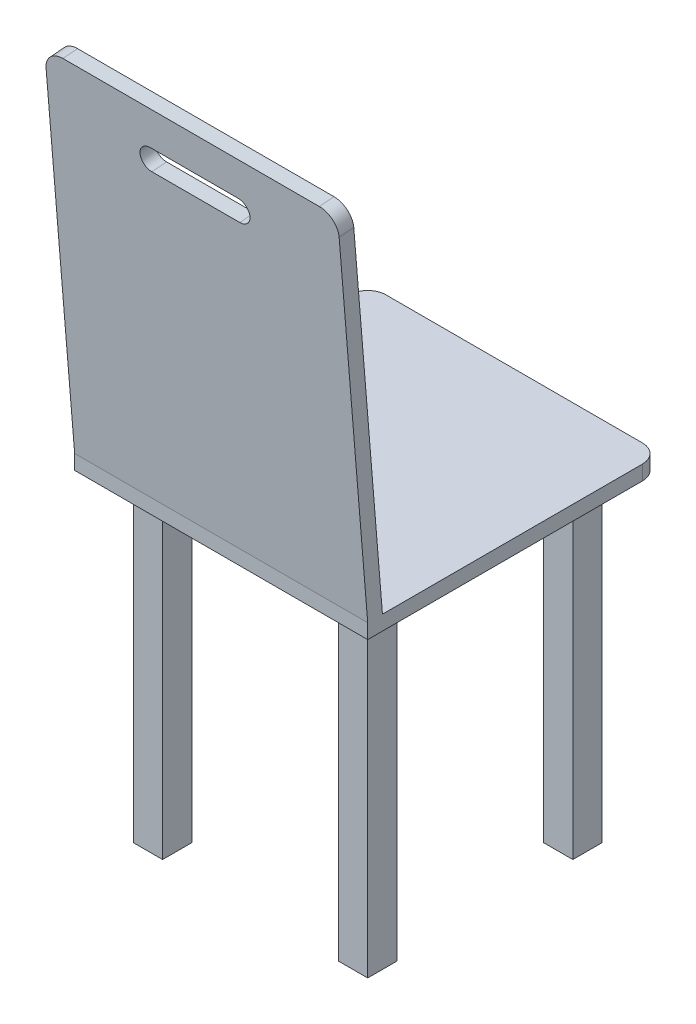
ISO-10303-21;
HEADER;
FILE_DESCRIPTION(('STEP AP214'),'2;1');
FILE_NAME('part.step','',(''),(''),'','','');
FILE_SCHEMA(('AUTOMOTIVE_DESIGN { 1 0 10303 214 1 1 1 1 }'));
ENDSEC;
DATA;
#1=APPLICATION_CONTEXT('core data for automotive mechanical design processes');
#2=APPLICATION_PROTOCOL_DEFINITION('international standard','automotive_design',2000,#1);
#3=PRODUCT_CONTEXT('',#1,'mechanical');
#4=PRODUCT('Part','Part','',(#3));
#5=PRODUCT_RELATED_PRODUCT_CATEGORY('part','',(#4));
#6=PRODUCT_DEFINITION_FORMATION('','',#4);
#7=PRODUCT_DEFINITION_CONTEXT('part definition',#1,'design');
#8=PRODUCT_DEFINITION('design','',#6,#7);
#9=PRODUCT_DEFINITION_SHAPE('','',#8);
#10=(LENGTH_UNIT() NAMED_UNIT(*) SI_UNIT(.MILLI.,.METRE.));
#11=(NAMED_UNIT(*) PLANE_ANGLE_UNIT() SI_UNIT($,.RADIAN.));
#12=(NAMED_UNIT(*) SI_UNIT($,.STERADIAN.) SOLID_ANGLE_UNIT());
#13=UNCERTAINTY_MEASURE_WITH_UNIT(LENGTH_MEASURE(1.E-05),#10,'distance_accuracy_value','');
#14=(GEOMETRIC_REPRESENTATION_CONTEXT(3) GLOBAL_UNCERTAINTY_ASSIGNED_CONTEXT((#13)) GLOBAL_UNIT_ASSIGNED_CONTEXT((#10,
#11,#12)) REPRESENTATION_CONTEXT('',''));
#15=CARTESIAN_POINT('',(0.,0.,0.));
#16=DIRECTION('',(0.,0.,1.));
#17=DIRECTION('',(1.,0.,0.));
#18=AXIS2_PLACEMENT_3D('',#15,#16,#17);
#19=CARTESIAN_POINT('',(40.,0.,0.));
#20=DIRECTION('',(0.,1.,0.));
#21=DIRECTION('',(0.,0.,1.));
#22=AXIS2_PLACEMENT_3D('',#19,#20,#21);
#23=PLANE('',#22);
#24=DIRECTION('',(0.,0.,-1.));
#25=VECTOR('',#24,1.);
#26=CARTESIAN_POINT('',(4.,0.,-32.));
#27=LINE('',#26,#25);
#28=CARTESIAN_POINT('',(4.,0.,-32.));
#29=VERTEX_POINT('',#28);
#30=CARTESIAN_POINT('',(4.,0.,-36.));
#31=VERTEX_POINT('',#30);
#32=EDGE_CURVE('E266',#29,#31,#27,.T.);
#33=ORIENTED_EDGE('',*,*,#32,.F.);
#34=DIRECTION('',(-1.,0.,0.));
#35=VECTOR('',#34,1.);
#36=CARTESIAN_POINT('',(4.,0.,-32.));
#37=LINE('',#36,#35);
#38=CARTESIAN_POINT('',(8.,0.,-32.));
#39=VERTEX_POINT('',#38);
#40=EDGE_CURVE('E282',#39,#29,#37,.T.);
#41=ORIENTED_EDGE('',*,*,#40,.F.);
#42=DIRECTION('',(0.,0.,1.));
#43=VECTOR('',#42,1.);
#44=CARTESIAN_POINT('',(8.,0.,-32.));
#45=LINE('',#44,#43);
#46=CARTESIAN_POINT('',(8.,0.,-36.));
#47=VERTEX_POINT('',#46);
#48=EDGE_CURVE('E295',#47,#39,#45,.T.);
#49=ORIENTED_EDGE('',*,*,#48,.F.);
#50=DIRECTION('',(1.,0.,0.));
#51=VECTOR('',#50,1.);
#52=CARTESIAN_POINT('',(4.,0.,-36.));
#53=LINE('',#52,#51);
#54=EDGE_CURVE('E271',#31,#47,#53,.T.);
#55=ORIENTED_EDGE('',*,*,#54,.F.);
#56=EDGE_LOOP('',(#33,#41,#49,#55));
#57=FACE_BOUND('',#56,.T.);
#58=DIRECTION('',(0.,0.,1.));
#59=VECTOR('',#58,1.);
#60=CARTESIAN_POINT('',(36.,0.,-4.));
#61=LINE('',#60,#59);
#62=CARTESIAN_POINT('',(36.,0.,-8.));
#63=VERTEX_POINT('',#62);
#64=CARTESIAN_POINT('',(36.,0.,-4.));
#65=VERTEX_POINT('',#64);
#66=EDGE_CURVE('E362',#63,#65,#61,.T.);
#67=ORIENTED_EDGE('',*,*,#66,.F.);
#68=DIRECTION('',(1.,0.,0.));
#69=VECTOR('',#68,1.);
#70=CARTESIAN_POINT('',(36.,0.,-8.));
#71=LINE('',#70,#69);
#72=CARTESIAN_POINT('',(32.,0.,-8.));
#73=VERTEX_POINT('',#72);
#74=EDGE_CURVE('E368',#73,#63,#71,.T.);
#75=ORIENTED_EDGE('',*,*,#74,.F.);
#76=DIRECTION('',(0.,0.,-1.));
#77=VECTOR('',#76,1.);
#78=CARTESIAN_POINT('',(32.,0.,-4.));
#79=LINE('',#78,#77);
#80=CARTESIAN_POINT('',(32.,0.,-4.));
#81=VERTEX_POINT('',#80);
#82=EDGE_CURVE('E385',#81,#73,#79,.T.);
#83=ORIENTED_EDGE('',*,*,#82,.F.);
#84=DIRECTION('',(-1.,0.,0.));
#85=VECTOR('',#84,1.);
#86=CARTESIAN_POINT('',(36.,0.,-4.));
#87=LINE('',#86,#85);
#88=EDGE_CURVE('E381',#65,#81,#87,.T.);
#89=ORIENTED_EDGE('',*,*,#88,.F.);
#90=EDGE_LOOP('',(#67,#75,#83,#89));
#91=FACE_BOUND('',#90,.T.);
#92=DIRECTION('',(-1.,0.,0.));
#93=VECTOR('',#92,1.);
#94=CARTESIAN_POINT('',(40.,0.,-40.));
#95=LINE('',#94,#93);
#96=CARTESIAN_POINT('',(37.5,0.,-40.));
#97=VERTEX_POINT('',#96);
#98=CARTESIAN_POINT('',(2.5,0.,-40.));
#99=VERTEX_POINT('',#98);
#100=EDGE_CURVE('E507',#97,#99,#95,.T.);
#101=ORIENTED_EDGE('',*,*,#100,.F.);
#102=CARTESIAN_POINT('',(37.5,0.,-37.5));
#103=DIRECTION('',(0.,1.,0.));
#104=DIRECTION('',(0.,0.,1.));
#105=AXIS2_PLACEMENT_3D('',#102,#103,#104);
#106=CIRCLE('',#105,2.5);
#107=CARTESIAN_POINT('',(40.,0.,-37.5));
#108=VERTEX_POINT('',#107);
#109=EDGE_CURVE('E539',#97,#108,#106,.F.);
#110=ORIENTED_EDGE('',*,*,#109,.T.);
#111=DIRECTION('',(0.,0.,-1.));
#112=VECTOR('',#111,1.);
#113=CARTESIAN_POINT('',(40.,0.,0.));
#114=LINE('',#113,#112);
#115=CARTESIAN_POINT('',(40.,0.,0.));
#116=VERTEX_POINT('',#115);
#117=EDGE_CURVE('E456',#116,#108,#114,.T.);
#118=ORIENTED_EDGE('',*,*,#117,.F.);
#119=DIRECTION('',(-1.,0.,0.));
#120=VECTOR('',#119,1.);
#121=CARTESIAN_POINT('',(40.,0.,0.));
#122=LINE('',#121,#120);
#123=CARTESIAN_POINT('',(0.,0.,0.));
#124=VERTEX_POINT('',#123);
#125=EDGE_CURVE('E511',#116,#124,#122,.T.);
#126=ORIENTED_EDGE('',*,*,#125,.T.);
#127=DIRECTION('',(0.,0.,-1.));
#128=VECTOR('',#127,1.);
#129=CARTESIAN_POINT('',(0.,0.,0.));
#130=LINE('',#129,#128);
#131=CARTESIAN_POINT('',(0.,0.,-37.5));
#132=VERTEX_POINT('',#131);
#133=EDGE_CURVE('E475',#124,#132,#130,.T.);
#134=ORIENTED_EDGE('',*,*,#133,.T.);
#135=CARTESIAN_POINT('',(2.5,0.,-37.5));
#136=DIRECTION('',(0.,1.,0.));
#137=DIRECTION('',(0.,0.,1.));
#138=AXIS2_PLACEMENT_3D('',#135,#136,#137);
#139=CIRCLE('',#138,2.5);
#140=EDGE_CURVE('E536',#132,#99,#139,.F.);
#141=ORIENTED_EDGE('',*,*,#140,.T.);
#142=EDGE_LOOP('',(#101,#110,#118,#126,#134,#141));
#143=FACE_BOUND('',#142,.T.);
#144=DIRECTION('',(0.,0.,-1.));
#145=VECTOR('',#144,1.);
#146=CARTESIAN_POINT('',(4.,0.,-4.));
#147=LINE('',#146,#145);
#148=CARTESIAN_POINT('',(4.,0.,-4.));
#149=VERTEX_POINT('',#148);
#150=CARTESIAN_POINT('',(4.,0.,-8.));
#151=VERTEX_POINT('',#150);
#152=EDGE_CURVE('E317',#149,#151,#147,.T.);
#153=ORIENTED_EDGE('',*,*,#152,.F.);
#154=DIRECTION('',(-1.,0.,0.));
#155=VECTOR('',#154,1.);
#156=CARTESIAN_POINT('',(4.,0.,-4.));
#157=LINE('',#156,#155);
#158=CARTESIAN_POINT('',(8.,0.,-4.));
#159=VERTEX_POINT('',#158);
#160=EDGE_CURVE('E323',#159,#149,#157,.T.);
#161=ORIENTED_EDGE('',*,*,#160,.F.);
#162=DIRECTION('',(0.,0.,1.));
#163=VECTOR('',#162,1.);
#164=CARTESIAN_POINT('',(8.,0.,-4.));
#165=LINE('',#164,#163);
#166=CARTESIAN_POINT('',(8.,0.,-8.));
#167=VERTEX_POINT('',#166);
#168=EDGE_CURVE('E340',#167,#159,#165,.T.);
#169=ORIENTED_EDGE('',*,*,#168,.F.);
#170=DIRECTION('',(1.,0.,0.));
#171=VECTOR('',#170,1.);
#172=CARTESIAN_POINT('',(4.,0.,-8.));
#173=LINE('',#172,#171);
#174=EDGE_CURVE('E336',#151,#167,#173,.T.);
#175=ORIENTED_EDGE('',*,*,#174,.F.);
#176=EDGE_LOOP('',(#153,#161,#169,#175));
#177=FACE_BOUND('',#176,.T.);
#178=DIRECTION('',(0.,0.,-1.));
#179=VECTOR('',#178,1.);
#180=CARTESIAN_POINT('',(32.,0.,-32.));
#181=LINE('',#180,#179);
#182=CARTESIAN_POINT('',(32.,0.,-32.));
#183=VERTEX_POINT('',#182);
#184=CARTESIAN_POINT('',(32.,0.,-36.));
#185=VERTEX_POINT('',#184);
#186=EDGE_CURVE('E264',#183,#185,#181,.T.);
#187=ORIENTED_EDGE('',*,*,#186,.F.);
#188=DIRECTION('',(-1.,0.,0.));
#189=VECTOR('',#188,1.);
#190=CARTESIAN_POINT('',(32.,0.,-32.));
#191=LINE('',#190,#189);
#192=CARTESIAN_POINT('',(36.,0.,-32.));
#193=VERTEX_POINT('',#192);
#194=EDGE_CURVE('E261',#193,#183,#191,.T.);
#195=ORIENTED_EDGE('',*,*,#194,.F.);
#196=DIRECTION('',(0.,0.,1.));
#197=VECTOR('',#196,1.);
#198=CARTESIAN_POINT('',(36.,0.,-32.));
#199=LINE('',#198,#197);
#200=CARTESIAN_POINT('',(36.,0.,-36.));
#201=VERTEX_POINT('',#200);
#202=EDGE_CURVE('E60',#201,#193,#199,.T.);
#203=ORIENTED_EDGE('',*,*,#202,.F.);
#204=DIRECTION('',(1.,0.,0.));
#205=VECTOR('',#204,1.);
#206=CARTESIAN_POINT('',(32.,0.,-36.));
#207=LINE('',#206,#205);
#208=EDGE_CURVE('E55',#185,#201,#207,.T.);
#209=ORIENTED_EDGE('',*,*,#208,.F.);
#210=EDGE_LOOP('',(#187,#195,#203,#209));
#211=FACE_BOUND('',#210,.T.);
#212=ADVANCED_FACE('F39',(#57,#91,#143,#177,#211),#23,.F.);
#213=CARTESIAN_POINT('',(40.,2.,0.));
#214=DIRECTION('',(0.,0.,-1.));
#215=DIRECTION('',(0.,1.,0.));
#216=AXIS2_PLACEMENT_3D('',#213,#214,#215);
#217=PLANE('',#216);
#218=DIRECTION('',(0.,-1.,0.));
#219=VECTOR('',#218,1.);
#220=CARTESIAN_POINT('',(0.,2.,0.));
#221=LINE('',#220,#219);
#222=CARTESIAN_POINT('',(0.,2.,0.));
#223=VERTEX_POINT('',#222);
#224=EDGE_CURVE('E451',#223,#124,#221,.T.);
#225=ORIENTED_EDGE('',*,*,#224,.T.);
#226=ORIENTED_EDGE('',*,*,#125,.F.);
#227=DIRECTION('',(0.,-1.,0.));
#228=VECTOR('',#227,1.);
#229=CARTESIAN_POINT('',(40.,2.,0.));
#230=LINE('',#229,#228);
#231=CARTESIAN_POINT('',(40.,2.,0.));
#232=VERTEX_POINT('',#231);
#233=EDGE_CURVE('E452',#232,#116,#230,.T.);
#234=ORIENTED_EDGE('',*,*,#233,.F.);
#235=DIRECTION('',(-1.,0.,0.));
#236=VECTOR('',#235,1.);
#237=CARTESIAN_POINT('',(40.,2.,0.));
#238=LINE('',#237,#236);
#239=EDGE_CURVE('E471',#232,#223,#238,.T.);
#240=ORIENTED_EDGE('',*,*,#239,.T.);
#241=EDGE_LOOP('',(#225,#226,#234,#240));
#242=FACE_BOUND('',#241,.T.);
#243=ADVANCED_FACE('F593',(#242),#217,.F.);
#244=CARTESIAN_POINT('',(40.,0.,-40.));
#245=DIRECTION('',(0.,0.,1.));
#246=DIRECTION('',(1.,0.,0.));
#247=AXIS2_PLACEMENT_3D('',#244,#245,#246);
#248=PLANE('',#247);
#249=DIRECTION('',(-1.,0.,0.));
#250=VECTOR('',#249,1.);
#251=CARTESIAN_POINT('',(40.,2.,-40.));
#252=LINE('',#251,#250);
#253=CARTESIAN_POINT('',(37.5,2.,-40.));
#254=VERTEX_POINT('',#253);
#255=CARTESIAN_POINT('',(2.5,2.,-40.));
#256=VERTEX_POINT('',#255);
#257=EDGE_CURVE('E503',#254,#256,#252,.T.);
#258=ORIENTED_EDGE('',*,*,#257,.F.);
#259=DIRECTION('',(0.,1.,0.));
#260=VECTOR('',#259,1.);
#261=CARTESIAN_POINT('',(37.5,0.,-40.));
#262=LINE('',#261,#260);
#263=EDGE_CURVE('E533',#254,#97,#262,.F.);
#264=ORIENTED_EDGE('',*,*,#263,.T.);
#265=ORIENTED_EDGE('',*,*,#100,.T.);
#266=DIRECTION('',(0.,1.,0.));
#267=VECTOR('',#266,1.);
#268=CARTESIAN_POINT('',(2.5,0.,-40.));
#269=LINE('',#268,#267);
#270=EDGE_CURVE('E529',#99,#256,#269,.T.);
#271=ORIENTED_EDGE('',*,*,#270,.T.);
#272=EDGE_LOOP('',(#258,#264,#265,#271));
#273=FACE_BOUND('',#272,.T.);
#274=ADVANCED_FACE('F605',(#273),#248,.F.);
#275=CARTESIAN_POINT('',(40.,2.,-40.));
#276=DIRECTION('',(0.,-1.,0.));
#277=DIRECTION('',(0.,0.,-1.));
#278=AXIS2_PLACEMENT_3D('',#275,#276,#277);
#279=PLANE('',#278);
#280=DIRECTION('',(0.,0.,1.));
#281=VECTOR('',#280,1.);
#282=CARTESIAN_POINT('',(40.,2.,-40.));
#283=LINE('',#282,#281);
#284=CARTESIAN_POINT('',(40.,2.,-37.5));
#285=VERTEX_POINT('',#284);
#286=CARTESIAN_POINT('',(40.,2.,-2.01348029888666));
#287=VERTEX_POINT('',#286);
#288=EDGE_CURVE('E461',#285,#287,#283,.T.);
#289=ORIENTED_EDGE('',*,*,#288,.F.);
#290=CARTESIAN_POINT('',(37.5,2.,-37.5));
#291=DIRECTION('',(0.,-1.,0.));
#292=DIRECTION('',(0.,0.,-1.));
#293=AXIS2_PLACEMENT_3D('',#290,#291,#292);
#294=CIRCLE('',#293,2.5);
#295=EDGE_CURVE('E526',#285,#254,#294,.F.);
#296=ORIENTED_EDGE('',*,*,#295,.T.);
#297=ORIENTED_EDGE('',*,*,#257,.T.);
#298=CARTESIAN_POINT('',(2.5,2.,-37.5));
#299=DIRECTION('',(0.,-1.,0.));
#300=DIRECTION('',(0.,0.,-1.));
#301=AXIS2_PLACEMENT_3D('',#298,#299,#300);
#302=CIRCLE('',#301,2.5);
#303=CARTESIAN_POINT('',(0.,2.,-37.5));
#304=VERTEX_POINT('',#303);
#305=EDGE_CURVE('E523',#256,#304,#302,.F.);
#306=ORIENTED_EDGE('',*,*,#305,.T.);
#307=DIRECTION('',(0.,0.,1.));
#308=VECTOR('',#307,1.);
#309=CARTESIAN_POINT('',(0.,2.,-40.));
#310=LINE('',#309,#308);
#311=CARTESIAN_POINT('',(0.,2.,-2.01348029888666));
#312=VERTEX_POINT('',#311);
#313=EDGE_CURVE('E479',#304,#312,#310,.T.);
#314=ORIENTED_EDGE('',*,*,#313,.T.);
#315=DIRECTION('',(-1.,0.,0.));
#316=VECTOR('',#315,1.);
#317=CARTESIAN_POINT('',(40.,2.,-2.01348029888666));
#318=LINE('',#317,#316);
#319=EDGE_CURVE('E499',#287,#312,#318,.T.);
#320=ORIENTED_EDGE('',*,*,#319,.F.);
#321=EDGE_LOOP('',(#289,#296,#297,#306,#314,#320));
#322=FACE_BOUND('',#321,.T.);
#323=ADVANCED_FACE('F603',(#322),#279,.F.);
#324=CARTESIAN_POINT('',(40.,52.1641968263193,2.10492065798135));
#325=DIRECTION('',(0.,-0.0818231262001709,0.996646866256464));
#326=DIRECTION('',(0.,-0.996646866256464,-0.0818231262001709));
#327=AXIS2_PLACEMENT_3D('',#324,#325,#326);
#328=PLANE('',#327);
#329=DIRECTION('',(-1.,0.,0.));
#330=VECTOR('',#329,1.);
#331=CARTESIAN_POINT('',(40.,47.180962495037,1.6958050269805));
#332=LINE('',#331,#330);
#333=CARTESIAN_POINT('',(26.,47.180962495037,1.6958050269805));
#334=VERTEX_POINT('',#333);
#335=CARTESIAN_POINT('',(14.,47.180962495037,1.6958050269805));
#336=VERTEX_POINT('',#335);
#337=EDGE_CURVE('E443',#334,#336,#332,.T.);
#338=ORIENTED_EDGE('',*,*,#337,.T.);
#339=CARTESIAN_POINT('',(14.,45.6859921956523,1.57307033768024));
#340=DIRECTION('',(0.,-0.0818231262001709,0.996646866256464));
#341=DIRECTION('',(0.,-0.996646866256464,-0.0818231262001709));
#342=AXIS2_PLACEMENT_3D('',#339,#340,#341);
#343=CIRCLE('',#342,1.5);
#344=CARTESIAN_POINT('',(14.,44.1910218962676,1.45033564837998));
#345=VERTEX_POINT('',#344);
#346=EDGE_CURVE('E447',#336,#345,#343,.T.);
#347=ORIENTED_EDGE('',*,*,#346,.T.);
#348=DIRECTION('',(1.,0.,0.));
#349=VECTOR('',#348,1.);
#350=CARTESIAN_POINT('',(40.,44.1910218962676,1.45033564837998));
#351=LINE('',#350,#349);
#352=CARTESIAN_POINT('',(26.,44.1910218962676,1.45033564837998));
#353=VERTEX_POINT('',#352);
#354=EDGE_CURVE('E426',#345,#353,#351,.T.);
#355=ORIENTED_EDGE('',*,*,#354,.T.);
#356=CARTESIAN_POINT('',(26.,45.6859921956523,1.57307033768024));
#357=DIRECTION('',(0.,-0.0818231262001709,0.996646866256464));
#358=DIRECTION('',(0.,-0.996646866256464,-0.0818231262001709));
#359=AXIS2_PLACEMENT_3D('',#356,#357,#358);
#360=CIRCLE('',#359,1.5);
#361=EDGE_CURVE('E439',#353,#334,#360,.T.);
#362=ORIENTED_EDGE('',*,*,#361,.T.);
#363=EDGE_LOOP('',(#338,#347,#355,#362));
#364=FACE_BOUND('',#363,.T.);
#365=DIRECTION('',(0.,0.996646866256464,0.0818231262001709));
#366=VECTOR('',#365,1.);
#367=CARTESIAN_POINT('',(0.,52.1641968263193,2.10492065798135));
#368=LINE('',#367,#366);
#369=CARTESIAN_POINT('',(0.,49.6725796606781,1.90036284248092));
#370=VERTEX_POINT('',#369);
#371=EDGE_CURVE('E482',#312,#370,#368,.T.);
#372=ORIENTED_EDGE('',*,*,#371,.T.);
#373=CARTESIAN_POINT('',(2.5,49.6725796606781,1.90036284248092));
#374=DIRECTION('',(0.,-0.0818231262001709,0.996646866256464));
#375=DIRECTION('',(0.,-0.996646866256464,-0.0818231262001709));
#376=AXIS2_PLACEMENT_3D('',#373,#374,#375);
#377=CIRCLE('',#376,2.5);
#378=CARTESIAN_POINT('',(2.5,52.1641968263193,2.10492065798135));
#379=VERTEX_POINT('',#378);
#380=EDGE_CURVE('E11',#370,#379,#377,.F.);
#381=ORIENTED_EDGE('',*,*,#380,.T.);
#382=DIRECTION('',(-1.,0.,0.));
#383=VECTOR('',#382,1.);
#384=CARTESIAN_POINT('',(40.,52.1641968263193,2.10492065798135));
#385=LINE('',#384,#383);
#386=CARTESIAN_POINT('',(37.5,52.1641968263193,2.10492065798135));
#387=VERTEX_POINT('',#386);
#388=EDGE_CURVE('E495',#387,#379,#385,.T.);
#389=ORIENTED_EDGE('',*,*,#388,.F.);
#390=CARTESIAN_POINT('',(37.5,49.6725796606781,1.90036284248092));
#391=DIRECTION('',(0.,-0.0818231262001709,0.996646866256464));
#392=DIRECTION('',(0.,-0.996646866256464,-0.0818231262001709));
#393=AXIS2_PLACEMENT_3D('',#390,#391,#392);
#394=CIRCLE('',#393,2.5);
#395=CARTESIAN_POINT('',(40.,49.6725796606781,1.90036284248092));
#396=VERTEX_POINT('',#395);
#397=EDGE_CURVE('E48',#387,#396,#394,.F.);
#398=ORIENTED_EDGE('',*,*,#397,.T.);
#399=DIRECTION('',(0.,0.996646866256464,0.0818231262001709));
#400=VECTOR('',#399,1.);
#401=CARTESIAN_POINT('',(40.,52.1641968263193,2.10492065798135));
#402=LINE('',#401,#400);
#403=EDGE_CURVE('E464',#287,#396,#402,.T.);
#404=ORIENTED_EDGE('',*,*,#403,.F.);
#405=ORIENTED_EDGE('',*,*,#319,.T.);
#406=EDGE_LOOP('',(#372,#381,#389,#398,#404,#405));
#407=FACE_BOUND('',#406,.T.);
#408=ADVANCED_FACE('F565',(#364,#407),#328,.F.);
#409=CARTESIAN_POINT('',(40.,52.,4.10492065798135));
#410=DIRECTION('',(0.,-0.996646866256464,-0.081823126200171));
#411=DIRECTION('',(0.,0.081823126200171,-0.996646866256464));
#412=AXIS2_PLACEMENT_3D('',#409,#410,#411);
#413=PLANE('',#412);
#414=ORIENTED_EDGE('',*,*,#388,.T.);
#415=DIRECTION('',(0.,-0.081823126200171,0.996646866256464));
#416=VECTOR('',#415,1.);
#417=CARTESIAN_POINT('',(2.5,52.,4.10492065798135));
#418=LINE('',#417,#416);
#419=CARTESIAN_POINT('',(2.5,52.,4.10492065798135));
#420=VERTEX_POINT('',#419);
#421=EDGE_CURVE('E551',#379,#420,#418,.T.);
#422=ORIENTED_EDGE('',*,*,#421,.T.);
#423=DIRECTION('',(-1.,0.,0.));
#424=VECTOR('',#423,1.);
#425=CARTESIAN_POINT('',(40.,52.,4.10492065798135));
#426=LINE('',#425,#424);
#427=CARTESIAN_POINT('',(37.5,52.,4.10492065798135));
#428=VERTEX_POINT('',#427);
#429=EDGE_CURVE('E491',#428,#420,#426,.T.);
#430=ORIENTED_EDGE('',*,*,#429,.F.);
#431=DIRECTION('',(0.,-0.081823126200171,0.996646866256464));
#432=VECTOR('',#431,1.);
#433=CARTESIAN_POINT('',(37.5,52.1641968263193,2.10492065798135));
#434=LINE('',#433,#432);
#435=EDGE_CURVE('E548',#428,#387,#434,.F.);
#436=ORIENTED_EDGE('',*,*,#435,.T.);
#437=EDGE_LOOP('',(#414,#422,#430,#436));
#438=FACE_BOUND('',#437,.T.);
#439=ADVANCED_FACE('F579',(#438),#413,.F.);
#440=CARTESIAN_POINT('',(40.,2.,0.));
#441=DIRECTION('',(0.,0.0818231262001707,-0.996646866256464));
#442=DIRECTION('',(0.,0.996646866256464,0.0818231262001707));
#443=AXIS2_PLACEMENT_3D('',#440,#441,#442);
#444=PLANE('',#443);
#445=DIRECTION('',(1.,0.,0.));
#446=VECTOR('',#445,1.);
#447=CARTESIAN_POINT('',(26.,44.0268250699483,3.45033564837999));
#448=LINE('',#447,#446);
#449=CARTESIAN_POINT('',(14.,44.0268250699483,3.45033564837998));
#450=VERTEX_POINT('',#449);
#451=CARTESIAN_POINT('',(26.,44.0268250699483,3.45033564837999));
#452=VERTEX_POINT('',#451);
#453=EDGE_CURVE('E410',#450,#452,#448,.T.);
#454=ORIENTED_EDGE('',*,*,#453,.F.);
#455=CARTESIAN_POINT('',(14.,45.521795369333,3.57307033768024));
#456=DIRECTION('',(0.,-0.0818231262001708,0.996646866256465));
#457=DIRECTION('',(0.,0.996646866256465,0.0818231262001708));
#458=AXIS2_PLACEMENT_3D('',#455,#456,#457);
#459=CIRCLE('',#458,1.5);
#460=CARTESIAN_POINT('',(14.,47.0167656687177,3.6958050269805));
#461=VERTEX_POINT('',#460);
#462=EDGE_CURVE('E407',#461,#450,#459,.T.);
#463=ORIENTED_EDGE('',*,*,#462,.F.);
#464=DIRECTION('',(-1.,0.,0.));
#465=VECTOR('',#464,1.);
#466=CARTESIAN_POINT('',(14.,47.0167656687177,3.6958050269805));
#467=LINE('',#466,#465);
#468=CARTESIAN_POINT('',(26.,47.0167656687177,3.6958050269805));
#469=VERTEX_POINT('',#468);
#470=EDGE_CURVE('E418',#469,#461,#467,.T.);
#471=ORIENTED_EDGE('',*,*,#470,.F.);
#472=CARTESIAN_POINT('',(26.,45.521795369333,3.57307033768024));
#473=DIRECTION('',(0.,-0.0818231262001708,0.996646866256465));
#474=DIRECTION('',(0.,0.996646866256465,0.0818231262001708));
#475=AXIS2_PLACEMENT_3D('',#472,#473,#474);
#476=CIRCLE('',#475,1.5);
#477=EDGE_CURVE('E414',#452,#469,#476,.T.);
#478=ORIENTED_EDGE('',*,*,#477,.F.);
#479=EDGE_LOOP('',(#454,#463,#471,#478));
#480=FACE_BOUND('',#479,.T.);
#481=ORIENTED_EDGE('',*,*,#429,.T.);
#482=CARTESIAN_POINT('',(2.5,49.5083828343588,3.90036284248092));
#483=DIRECTION('',(0.,0.0818231262001707,-0.996646866256464));
#484=DIRECTION('',(0.,0.996646866256464,0.0818231262001707));
#485=AXIS2_PLACEMENT_3D('',#482,#483,#484);
#486=CIRCLE('',#485,2.5);
#487=CARTESIAN_POINT('',(0.,49.5083828343588,3.90036284248092));
#488=VERTEX_POINT('',#487);
#489=EDGE_CURVE('E558',#420,#488,#486,.F.);
#490=ORIENTED_EDGE('',*,*,#489,.T.);
#491=DIRECTION('',(0.,-0.996646866256464,-0.0818231262001707));
#492=VECTOR('',#491,1.);
#493=CARTESIAN_POINT('',(0.,2.,0.));
#494=LINE('',#493,#492);
#495=EDGE_CURVE('E457',#488,#223,#494,.T.);
#496=ORIENTED_EDGE('',*,*,#495,.T.);
#497=ORIENTED_EDGE('',*,*,#239,.F.);
#498=DIRECTION('',(0.,-0.996646866256464,-0.0818231262001707));
#499=VECTOR('',#498,1.);
#500=CARTESIAN_POINT('',(40.,2.,0.));
#501=LINE('',#500,#499);
#502=CARTESIAN_POINT('',(40.,49.5083828343588,3.90036284248092));
#503=VERTEX_POINT('',#502);
#504=EDGE_CURVE('E468',#503,#232,#501,.T.);
#505=ORIENTED_EDGE('',*,*,#504,.F.);
#506=CARTESIAN_POINT('',(37.5,49.5083828343588,3.90036284248092));
#507=DIRECTION('',(0.,0.0818231262001707,-0.996646866256464));
#508=DIRECTION('',(0.,0.996646866256464,0.0818231262001707));
#509=AXIS2_PLACEMENT_3D('',#506,#507,#508);
#510=CIRCLE('',#509,2.5);
#511=EDGE_CURVE('E555',#503,#428,#510,.F.);
#512=ORIENTED_EDGE('',*,*,#511,.T.);
#513=EDGE_LOOP('',(#481,#490,#496,#497,#505,#512));
#514=FACE_BOUND('',#513,.T.);
#515=ADVANCED_FACE('F576',(#480,#514),#444,.F.);
#516=CARTESIAN_POINT('',(40.,0.,0.));
#517=DIRECTION('',(1.,0.,0.));
#518=DIRECTION('',(0.,0.,-1.));
#519=AXIS2_PLACEMENT_3D('',#516,#517,#518);
#520=PLANE('',#519);
#521=ORIENTED_EDGE('',*,*,#117,.T.);
#522=DIRECTION('',(0.,1.,0.));
#523=VECTOR('',#522,1.);
#524=CARTESIAN_POINT('',(40.,2.,-37.5));
#525=LINE('',#524,#523);
#526=EDGE_CURVE('E519',#108,#285,#525,.T.);
#527=ORIENTED_EDGE('',*,*,#526,.T.);
#528=ORIENTED_EDGE('',*,*,#288,.T.);
#529=ORIENTED_EDGE('',*,*,#403,.T.);
#530=DIRECTION('',(0.,-0.081823126200171,0.996646866256464));
#531=VECTOR('',#530,1.);
#532=CARTESIAN_POINT('',(40.,49.5083828343588,3.90036284248092));
#533=LINE('',#532,#531);
#534=EDGE_CURVE('E515',#396,#503,#533,.T.);
#535=ORIENTED_EDGE('',*,*,#534,.T.);
#536=ORIENTED_EDGE('',*,*,#504,.T.);
#537=ORIENTED_EDGE('',*,*,#233,.T.);
#538=EDGE_LOOP('',(#521,#527,#528,#529,#535,#536,#537));
#539=FACE_BOUND('',#538,.T.);
#540=ADVANCED_FACE('F570',(#539),#520,.T.);
#541=CARTESIAN_POINT('',(0.,0.,0.));
#542=DIRECTION('',(1.,0.,0.));
#543=DIRECTION('',(0.,0.,-1.));
#544=AXIS2_PLACEMENT_3D('',#541,#542,#543);
#545=PLANE('',#544);
#546=ORIENTED_EDGE('',*,*,#313,.F.);
#547=DIRECTION('',(0.,1.,0.));
#548=VECTOR('',#547,1.);
#549=CARTESIAN_POINT('',(0.,0.,-37.5));
#550=LINE('',#549,#548);
#551=EDGE_CURVE('E545',#304,#132,#550,.F.);
#552=ORIENTED_EDGE('',*,*,#551,.T.);
#553=ORIENTED_EDGE('',*,*,#133,.F.);
#554=ORIENTED_EDGE('',*,*,#224,.F.);
#555=ORIENTED_EDGE('',*,*,#495,.F.);
#556=DIRECTION('',(0.,-0.081823126200171,0.996646866256464));
#557=VECTOR('',#556,1.);
#558=CARTESIAN_POINT('',(0.,49.4949927863965,4.06346036711035));
#559=LINE('',#558,#557);
#560=EDGE_CURVE('E542',#488,#370,#559,.F.);
#561=ORIENTED_EDGE('',*,*,#560,.T.);
#562=ORIENTED_EDGE('',*,*,#371,.F.);
#563=EDGE_LOOP('',(#546,#552,#553,#554,#555,#561,#562));
#564=FACE_BOUND('',#563,.T.);
#565=ADVANCED_FACE('F589',(#564),#545,.F.);
#566=CARTESIAN_POINT('',(37.5,0.,-37.5));
#567=DIRECTION('',(0.,-1.,0.));
#568=DIRECTION('',(0.,0.,-1.));
#569=AXIS2_PLACEMENT_3D('',#566,#567,#568);
#570=CYLINDRICAL_SURFACE('',#569,2.5);
#571=ORIENTED_EDGE('',*,*,#109,.F.);
#572=ORIENTED_EDGE('',*,*,#263,.F.);
#573=ORIENTED_EDGE('',*,*,#295,.F.);
#574=ORIENTED_EDGE('',*,*,#526,.F.);
#575=EDGE_LOOP('',(#571,#572,#573,#574));
#576=FACE_BOUND('',#575,.T.);
#577=ADVANCED_FACE('F599',(#576),#570,.T.);
#578=CARTESIAN_POINT('',(2.5,0.,-37.5));
#579=DIRECTION('',(0.,1.,0.));
#580=DIRECTION('',(0.,0.,1.));
#581=AXIS2_PLACEMENT_3D('',#578,#579,#580);
#582=CYLINDRICAL_SURFACE('',#581,2.5);
#583=ORIENTED_EDGE('',*,*,#140,.F.);
#584=ORIENTED_EDGE('',*,*,#551,.F.);
#585=ORIENTED_EDGE('',*,*,#305,.F.);
#586=ORIENTED_EDGE('',*,*,#270,.F.);
#587=EDGE_LOOP('',(#583,#584,#585,#586));
#588=FACE_BOUND('',#587,.T.);
#589=ADVANCED_FACE('F610',(#588),#582,.T.);
#590=CARTESIAN_POINT('',(2.5,49.5083828343588,3.90036284248092));
#591=DIRECTION('',(0.,-0.081823126200171,0.996646866256464));
#592=DIRECTION('',(0.,-0.996646866256464,-0.081823126200171));
#593=AXIS2_PLACEMENT_3D('',#590,#591,#592);
#594=CYLINDRICAL_SURFACE('',#593,2.5);
#595=ORIENTED_EDGE('',*,*,#380,.F.);
#596=ORIENTED_EDGE('',*,*,#560,.F.);
#597=ORIENTED_EDGE('',*,*,#489,.F.);
#598=ORIENTED_EDGE('',*,*,#421,.F.);
#599=EDGE_LOOP('',(#595,#596,#597,#598));
#600=FACE_BOUND('',#599,.T.);
#601=ADVANCED_FACE('F583',(#600),#594,.T.);
#602=CARTESIAN_POINT('',(37.5,49.4949927863965,4.06346036711035));
#603=DIRECTION('',(0.,0.081823126200171,-0.996646866256464));
#604=DIRECTION('',(0.,0.996646866256464,0.081823126200171));
#605=AXIS2_PLACEMENT_3D('',#602,#603,#604);
#606=CYLINDRICAL_SURFACE('',#605,2.5);
#607=ORIENTED_EDGE('',*,*,#397,.F.);
#608=ORIENTED_EDGE('',*,*,#435,.F.);
#609=ORIENTED_EDGE('',*,*,#511,.F.);
#610=ORIENTED_EDGE('',*,*,#534,.F.);
#611=EDGE_LOOP('',(#607,#608,#609,#610));
#612=FACE_BOUND('',#611,.T.);
#613=ADVANCED_FACE('F41',(#612),#606,.T.);
#614=CARTESIAN_POINT('',(14.,45.7672647479335,0.583129738910871));
#615=DIRECTION('',(0.,-0.0818231262001707,0.996646866256464));
#616=DIRECTION('',(0.,-0.996646866256465,-0.0818231262001708));
#617=AXIS2_PLACEMENT_3D('',#614,#615,#616);
#618=CYLINDRICAL_SURFACE('',#617,1.5);
#619=DIRECTION('',(0.,-0.0818231262001707,0.996646866256464));
#620=VECTOR('',#619,1.);
#621=CARTESIAN_POINT('',(14.,47.2622350473182,0.705864428211126));
#622=LINE('',#621,#620);
#623=EDGE_CURVE('E423',#336,#461,#622,.T.);
#624=ORIENTED_EDGE('',*,*,#623,.T.);
#625=ORIENTED_EDGE('',*,*,#462,.T.);
#626=DIRECTION('',(0.,-0.0818231262001707,0.996646866256464));
#627=VECTOR('',#626,1.);
#628=CARTESIAN_POINT('',(14.,44.2722944485488,0.460395049610615));
#629=LINE('',#628,#627);
#630=EDGE_CURVE('E422',#345,#450,#629,.T.);
#631=ORIENTED_EDGE('',*,*,#630,.F.);
#632=ORIENTED_EDGE('',*,*,#346,.F.);
#633=EDGE_LOOP('',(#624,#625,#631,#632));
#634=FACE_BOUND('',#633,.T.);
#635=ADVANCED_FACE('F716',(#634),#618,.F.);
#636=CARTESIAN_POINT('',(14.,47.2622350473182,0.705864428211126));
#637=DIRECTION('',(0.,0.996646866256464,0.0818231262001707));
#638=DIRECTION('',(0.,-0.0818231262001708,0.996646866256465));
#639=AXIS2_PLACEMENT_3D('',#636,#637,#638);
#640=PLANE('',#639);
#641=DIRECTION('',(0.,-0.0818231262001707,0.996646866256464));
#642=VECTOR('',#641,1.);
#643=CARTESIAN_POINT('',(26.,47.2622350473182,0.705864428211126));
#644=LINE('',#643,#642);
#645=EDGE_CURVE('E427',#334,#469,#644,.T.);
#646=ORIENTED_EDGE('',*,*,#645,.T.);
#647=ORIENTED_EDGE('',*,*,#470,.T.);
#648=ORIENTED_EDGE('',*,*,#623,.F.);
#649=ORIENTED_EDGE('',*,*,#337,.F.);
#650=EDGE_LOOP('',(#646,#647,#648,#649));
#651=FACE_BOUND('',#650,.T.);
#652=ADVANCED_FACE('F712',(#651),#640,.F.);
#653=CARTESIAN_POINT('',(26.,45.7672647479335,0.583129738910871));
#654=DIRECTION('',(0.,-0.0818231262001707,0.996646866256464));
#655=DIRECTION('',(0.,-0.996646866256465,-0.0818231262001708));
#656=AXIS2_PLACEMENT_3D('',#653,#654,#655);
#657=CYLINDRICAL_SURFACE('',#656,1.5);
#658=DIRECTION('',(0.,-0.0818231262001707,0.996646866256464));
#659=VECTOR('',#658,1.);
#660=CARTESIAN_POINT('',(26.,44.2722944485488,0.460395049610615));
#661=LINE('',#660,#659);
#662=EDGE_CURVE('E430',#353,#452,#661,.T.);
#663=ORIENTED_EDGE('',*,*,#662,.T.);
#664=ORIENTED_EDGE('',*,*,#477,.T.);
#665=ORIENTED_EDGE('',*,*,#645,.F.);
#666=ORIENTED_EDGE('',*,*,#361,.F.);
#667=EDGE_LOOP('',(#663,#664,#665,#666));
#668=FACE_BOUND('',#667,.T.);
#669=ADVANCED_FACE('F715',(#668),#657,.F.);
#670=CARTESIAN_POINT('',(26.,44.2722944485488,0.460395049610615));
#671=DIRECTION('',(0.,-0.996646866256464,-0.0818231262001707));
#672=DIRECTION('',(0.,0.0818231262001708,-0.996646866256465));
#673=AXIS2_PLACEMENT_3D('',#670,#671,#672);
#674=PLANE('',#673);
#675=ORIENTED_EDGE('',*,*,#630,.T.);
#676=ORIENTED_EDGE('',*,*,#453,.T.);
#677=ORIENTED_EDGE('',*,*,#662,.F.);
#678=ORIENTED_EDGE('',*,*,#354,.F.);
#679=EDGE_LOOP('',(#675,#676,#677,#678));
#680=FACE_BOUND('',#679,.T.);
#681=ADVANCED_FACE('F710',(#680),#674,.F.);
#682=CARTESIAN_POINT('',(36.,-44.,-4.));
#683=DIRECTION('',(-1.,0.,0.));
#684=DIRECTION('',(0.,0.,1.));
#685=AXIS2_PLACEMENT_3D('',#682,#683,#684);
#686=PLANE('',#685);
#687=ORIENTED_EDGE('',*,*,#66,.T.);
#688=DIRECTION('',(0.,1.,0.));
#689=VECTOR('',#688,1.);
#690=CARTESIAN_POINT('',(36.,-44.,-4.));
#691=LINE('',#690,#689);
#692=CARTESIAN_POINT('',(36.,-44.,-4.));
#693=VERTEX_POINT('',#692);
#694=EDGE_CURVE('E403',#693,#65,#691,.T.);
#695=ORIENTED_EDGE('',*,*,#694,.F.);
#696=DIRECTION('',(0.,0.,1.));
#697=VECTOR('',#696,1.);
#698=CARTESIAN_POINT('',(36.,-44.,-4.));
#699=LINE('',#698,#697);
#700=CARTESIAN_POINT('',(36.,-44.,-8.));
#701=VERTEX_POINT('',#700);
#702=EDGE_CURVE('E363',#701,#693,#699,.T.);
#703=ORIENTED_EDGE('',*,*,#702,.F.);
#704=DIRECTION('',(0.,1.,0.));
#705=VECTOR('',#704,1.);
#706=CARTESIAN_POINT('',(36.,-44.,-8.));
#707=LINE('',#706,#705);
#708=EDGE_CURVE('E377',#701,#63,#707,.T.);
#709=ORIENTED_EDGE('',*,*,#708,.T.);
#710=EDGE_LOOP('',(#687,#695,#703,#709));
#711=FACE_BOUND('',#710,.T.);
#712=ADVANCED_FACE('F706',(#711),#686,.F.);
#713=CARTESIAN_POINT('',(36.,-44.,-4.));
#714=DIRECTION('',(0.,0.,-1.));
#715=DIRECTION('',(-1.,0.,0.));
#716=AXIS2_PLACEMENT_3D('',#713,#714,#715);
#717=PLANE('',#716);
#718=ORIENTED_EDGE('',*,*,#88,.T.);
#719=DIRECTION('',(0.,1.,0.));
#720=VECTOR('',#719,1.);
#721=CARTESIAN_POINT('',(32.,-44.,-4.));
#722=LINE('',#721,#720);
#723=CARTESIAN_POINT('',(32.,-44.,-4.));
#724=VERTEX_POINT('',#723);
#725=EDGE_CURVE('E399',#724,#81,#722,.T.);
#726=ORIENTED_EDGE('',*,*,#725,.F.);
#727=DIRECTION('',(-1.,0.,0.));
#728=VECTOR('',#727,1.);
#729=CARTESIAN_POINT('',(36.,-44.,-4.));
#730=LINE('',#729,#728);
#731=EDGE_CURVE('E367',#693,#724,#730,.T.);
#732=ORIENTED_EDGE('',*,*,#731,.F.);
#733=ORIENTED_EDGE('',*,*,#694,.T.);
#734=EDGE_LOOP('',(#718,#726,#732,#733));
#735=FACE_BOUND('',#734,.T.);
#736=ADVANCED_FACE('F702',(#735),#717,.F.);
#737=CARTESIAN_POINT('',(32.,-44.,-4.));
#738=DIRECTION('',(1.,0.,0.));
#739=DIRECTION('',(0.,0.,-1.));
#740=AXIS2_PLACEMENT_3D('',#737,#738,#739);
#741=PLANE('',#740);
#742=ORIENTED_EDGE('',*,*,#82,.T.);
#743=DIRECTION('',(0.,1.,0.));
#744=VECTOR('',#743,1.);
#745=CARTESIAN_POINT('',(32.,-44.,-8.));
#746=LINE('',#745,#744);
#747=CARTESIAN_POINT('',(32.,-44.,-8.));
#748=VERTEX_POINT('',#747);
#749=EDGE_CURVE('E395',#748,#73,#746,.T.);
#750=ORIENTED_EDGE('',*,*,#749,.F.);
#751=DIRECTION('',(0.,0.,-1.));
#752=VECTOR('',#751,1.);
#753=CARTESIAN_POINT('',(32.,-44.,-4.));
#754=LINE('',#753,#752);
#755=EDGE_CURVE('E371',#724,#748,#754,.T.);
#756=ORIENTED_EDGE('',*,*,#755,.F.);
#757=ORIENTED_EDGE('',*,*,#725,.T.);
#758=EDGE_LOOP('',(#742,#750,#756,#757));
#759=FACE_BOUND('',#758,.T.);
#760=ADVANCED_FACE('F698',(#759),#741,.F.);
#761=CARTESIAN_POINT('',(36.,-44.,-8.));
#762=DIRECTION('',(0.,0.,1.));
#763=DIRECTION('',(1.,0.,0.));
#764=AXIS2_PLACEMENT_3D('',#761,#762,#763);
#765=PLANE('',#764);
#766=ORIENTED_EDGE('',*,*,#74,.T.);
#767=ORIENTED_EDGE('',*,*,#708,.F.);
#768=DIRECTION('',(1.,0.,0.));
#769=VECTOR('',#768,1.);
#770=CARTESIAN_POINT('',(36.,-44.,-8.));
#771=LINE('',#770,#769);
#772=EDGE_CURVE('E374',#748,#701,#771,.T.);
#773=ORIENTED_EDGE('',*,*,#772,.F.);
#774=ORIENTED_EDGE('',*,*,#749,.T.);
#775=EDGE_LOOP('',(#766,#767,#773,#774));
#776=FACE_BOUND('',#775,.T.);
#777=ADVANCED_FACE('F694',(#776),#765,.F.);
#778=CARTESIAN_POINT('',(0.,-44.,0.));
#779=DIRECTION('',(0.,1.,0.));
#780=DIRECTION('',(0.,0.,1.));
#781=AXIS2_PLACEMENT_3D('',#778,#779,#780);
#782=PLANE('',#781);
#783=ORIENTED_EDGE('',*,*,#702,.T.);
#784=ORIENTED_EDGE('',*,*,#731,.T.);
#785=ORIENTED_EDGE('',*,*,#755,.T.);
#786=ORIENTED_EDGE('',*,*,#772,.T.);
#787=EDGE_LOOP('',(#783,#784,#785,#786));
#788=FACE_BOUND('',#787,.T.);
#789=ADVANCED_FACE('F690',(#788),#782,.F.);
#790=CARTESIAN_POINT('',(4.,-44.,-4.));
#791=DIRECTION('',(1.,0.,0.));
#792=DIRECTION('',(0.,0.,-1.));
#793=AXIS2_PLACEMENT_3D('',#790,#791,#792);
#794=PLANE('',#793);
#795=ORIENTED_EDGE('',*,*,#152,.T.);
#796=DIRECTION('',(0.,1.,0.));
#797=VECTOR('',#796,1.);
#798=CARTESIAN_POINT('',(4.,-44.,-8.));
#799=LINE('',#798,#797);
#800=CARTESIAN_POINT('',(4.,-44.,-8.));
#801=VERTEX_POINT('',#800);
#802=EDGE_CURVE('E358',#801,#151,#799,.T.);
#803=ORIENTED_EDGE('',*,*,#802,.F.);
#804=DIRECTION('',(0.,0.,-1.));
#805=VECTOR('',#804,1.);
#806=CARTESIAN_POINT('',(4.,-44.,-4.));
#807=LINE('',#806,#805);
#808=CARTESIAN_POINT('',(4.,-44.,-4.));
#809=VERTEX_POINT('',#808);
#810=EDGE_CURVE('E318',#809,#801,#807,.T.);
#811=ORIENTED_EDGE('',*,*,#810,.F.);
#812=DIRECTION('',(0.,1.,0.));
#813=VECTOR('',#812,1.);
#814=CARTESIAN_POINT('',(4.,-44.,-4.));
#815=LINE('',#814,#813);
#816=EDGE_CURVE('E332',#809,#149,#815,.T.);
#817=ORIENTED_EDGE('',*,*,#816,.T.);
#818=EDGE_LOOP('',(#795,#803,#811,#817));
#819=FACE_BOUND('',#818,.T.);
#820=ADVANCED_FACE('F686',(#819),#794,.F.);
#821=CARTESIAN_POINT('',(4.,-44.,-8.));
#822=DIRECTION('',(0.,0.,1.));
#823=DIRECTION('',(1.,0.,0.));
#824=AXIS2_PLACEMENT_3D('',#821,#822,#823);
#825=PLANE('',#824);
#826=ORIENTED_EDGE('',*,*,#174,.T.);
#827=DIRECTION('',(0.,1.,0.));
#828=VECTOR('',#827,1.);
#829=CARTESIAN_POINT('',(8.,-44.,-8.));
#830=LINE('',#829,#828);
#831=CARTESIAN_POINT('',(8.,-44.,-8.));
#832=VERTEX_POINT('',#831);
#833=EDGE_CURVE('E354',#832,#167,#830,.T.);
#834=ORIENTED_EDGE('',*,*,#833,.F.);
#835=DIRECTION('',(1.,0.,0.));
#836=VECTOR('',#835,1.);
#837=CARTESIAN_POINT('',(4.,-44.,-8.));
#838=LINE('',#837,#836);
#839=EDGE_CURVE('E322',#801,#832,#838,.T.);
#840=ORIENTED_EDGE('',*,*,#839,.F.);
#841=ORIENTED_EDGE('',*,*,#802,.T.);
#842=EDGE_LOOP('',(#826,#834,#840,#841));
#843=FACE_BOUND('',#842,.T.);
#844=ADVANCED_FACE('F682',(#843),#825,.F.);
#845=CARTESIAN_POINT('',(8.,-44.,-4.));
#846=DIRECTION('',(-1.,0.,0.));
#847=DIRECTION('',(0.,0.,1.));
#848=AXIS2_PLACEMENT_3D('',#845,#846,#847);
#849=PLANE('',#848);
#850=ORIENTED_EDGE('',*,*,#168,.T.);
#851=DIRECTION('',(0.,1.,0.));
#852=VECTOR('',#851,1.);
#853=CARTESIAN_POINT('',(8.,-44.,-4.));
#854=LINE('',#853,#852);
#855=CARTESIAN_POINT('',(8.,-44.,-4.));
#856=VERTEX_POINT('',#855);
#857=EDGE_CURVE('E350',#856,#159,#854,.T.);
#858=ORIENTED_EDGE('',*,*,#857,.F.);
#859=DIRECTION('',(0.,0.,1.));
#860=VECTOR('',#859,1.);
#861=CARTESIAN_POINT('',(8.,-44.,-4.));
#862=LINE('',#861,#860);
#863=EDGE_CURVE('E326',#832,#856,#862,.T.);
#864=ORIENTED_EDGE('',*,*,#863,.F.);
#865=ORIENTED_EDGE('',*,*,#833,.T.);
#866=EDGE_LOOP('',(#850,#858,#864,#865));
#867=FACE_BOUND('',#866,.T.);
#868=ADVANCED_FACE('F678',(#867),#849,.F.);
#869=CARTESIAN_POINT('',(4.,-44.,-4.));
#870=DIRECTION('',(0.,0.,-1.));
#871=DIRECTION('',(-1.,0.,0.));
#872=AXIS2_PLACEMENT_3D('',#869,#870,#871);
#873=PLANE('',#872);
#874=ORIENTED_EDGE('',*,*,#160,.T.);
#875=ORIENTED_EDGE('',*,*,#816,.F.);
#876=DIRECTION('',(-1.,0.,0.));
#877=VECTOR('',#876,1.);
#878=CARTESIAN_POINT('',(4.,-44.,-4.));
#879=LINE('',#878,#877);
#880=EDGE_CURVE('E329',#856,#809,#879,.T.);
#881=ORIENTED_EDGE('',*,*,#880,.F.);
#882=ORIENTED_EDGE('',*,*,#857,.T.);
#883=EDGE_LOOP('',(#874,#875,#881,#882));
#884=FACE_BOUND('',#883,.T.);
#885=ADVANCED_FACE('F674',(#884),#873,.F.);
#886=CARTESIAN_POINT('',(0.,-44.,0.));
#887=DIRECTION('',(0.,-1.,0.));
#888=DIRECTION('',(0.,0.,-1.));
#889=AXIS2_PLACEMENT_3D('',#886,#887,#888);
#890=PLANE('',#889);
#891=ORIENTED_EDGE('',*,*,#810,.T.);
#892=ORIENTED_EDGE('',*,*,#839,.T.);
#893=ORIENTED_EDGE('',*,*,#863,.T.);
#894=ORIENTED_EDGE('',*,*,#880,.T.);
#895=EDGE_LOOP('',(#891,#892,#893,#894));
#896=FACE_BOUND('',#895,.T.);
#897=ADVANCED_FACE('F670',(#896),#890,.T.);
#898=CARTESIAN_POINT('',(4.,-44.,-32.));
#899=DIRECTION('',(1.,0.,0.));
#900=DIRECTION('',(0.,0.,-1.));
#901=AXIS2_PLACEMENT_3D('',#898,#899,#900);
#902=PLANE('',#901);
#903=ORIENTED_EDGE('',*,*,#32,.T.);
#904=DIRECTION('',(0.,1.,0.));
#905=VECTOR('',#904,1.);
#906=CARTESIAN_POINT('',(4.,-44.,-36.));
#907=LINE('',#906,#905);
#908=CARTESIAN_POINT('',(4.,-44.,-36.));
#909=VERTEX_POINT('',#908);
#910=EDGE_CURVE('E313',#909,#31,#907,.T.);
#911=ORIENTED_EDGE('',*,*,#910,.F.);
#912=DIRECTION('',(0.,0.,-1.));
#913=VECTOR('',#912,1.);
#914=CARTESIAN_POINT('',(4.,-44.,-32.));
#915=LINE('',#914,#913);
#916=CARTESIAN_POINT('',(4.,-44.,-32.));
#917=VERTEX_POINT('',#916);
#918=EDGE_CURVE('E277',#917,#909,#915,.T.);
#919=ORIENTED_EDGE('',*,*,#918,.F.);
#920=DIRECTION('',(0.,1.,0.));
#921=VECTOR('',#920,1.);
#922=CARTESIAN_POINT('',(4.,-44.,-32.));
#923=LINE('',#922,#921);
#924=EDGE_CURVE('E290',#917,#29,#923,.T.);
#925=ORIENTED_EDGE('',*,*,#924,.T.);
#926=EDGE_LOOP('',(#903,#911,#919,#925));
#927=FACE_BOUND('',#926,.T.);
#928=ADVANCED_FACE('F666',(#927),#902,.F.);
#929=CARTESIAN_POINT('',(4.,-44.,-36.));
#930=DIRECTION('',(0.,0.,1.));
#931=DIRECTION('',(1.,0.,0.));
#932=AXIS2_PLACEMENT_3D('',#929,#930,#931);
#933=PLANE('',#932);
#934=ORIENTED_EDGE('',*,*,#54,.T.);
#935=DIRECTION('',(0.,1.,0.));
#936=VECTOR('',#935,1.);
#937=CARTESIAN_POINT('',(8.,-44.,-36.));
#938=LINE('',#937,#936);
#939=CARTESIAN_POINT('',(8.,-44.,-36.));
#940=VERTEX_POINT('',#939);
#941=EDGE_CURVE('E309',#940,#47,#938,.T.);
#942=ORIENTED_EDGE('',*,*,#941,.F.);
#943=DIRECTION('',(1.,0.,0.));
#944=VECTOR('',#943,1.);
#945=CARTESIAN_POINT('',(4.,-44.,-36.));
#946=LINE('',#945,#944);
#947=EDGE_CURVE('E281',#909,#940,#946,.T.);
#948=ORIENTED_EDGE('',*,*,#947,.F.);
#949=ORIENTED_EDGE('',*,*,#910,.T.);
#950=EDGE_LOOP('',(#934,#942,#948,#949));
#951=FACE_BOUND('',#950,.T.);
#952=ADVANCED_FACE('F662',(#951),#933,.F.);
#953=CARTESIAN_POINT('',(8.,-44.,-32.));
#954=DIRECTION('',(-1.,0.,0.));
#955=DIRECTION('',(0.,0.,1.));
#956=AXIS2_PLACEMENT_3D('',#953,#954,#955);
#957=PLANE('',#956);
#958=ORIENTED_EDGE('',*,*,#48,.T.);
#959=DIRECTION('',(0.,1.,0.));
#960=VECTOR('',#959,1.);
#961=CARTESIAN_POINT('',(8.,-44.,-32.));
#962=LINE('',#961,#960);
#963=CARTESIAN_POINT('',(8.,-44.,-32.));
#964=VERTEX_POINT('',#963);
#965=EDGE_CURVE('E305',#964,#39,#962,.T.);
#966=ORIENTED_EDGE('',*,*,#965,.F.);
#967=DIRECTION('',(0.,0.,1.));
#968=VECTOR('',#967,1.);
#969=CARTESIAN_POINT('',(8.,-44.,-32.));
#970=LINE('',#969,#968);
#971=EDGE_CURVE('E285',#940,#964,#970,.T.);
#972=ORIENTED_EDGE('',*,*,#971,.F.);
#973=ORIENTED_EDGE('',*,*,#941,.T.);
#974=EDGE_LOOP('',(#958,#966,#972,#973));
#975=FACE_BOUND('',#974,.T.);
#976=ADVANCED_FACE('F658',(#975),#957,.F.);
#977=CARTESIAN_POINT('',(4.,-44.,-32.));
#978=DIRECTION('',(0.,0.,-1.));
#979=DIRECTION('',(-1.,0.,0.));
#980=AXIS2_PLACEMENT_3D('',#977,#978,#979);
#981=PLANE('',#980);
#982=ORIENTED_EDGE('',*,*,#40,.T.);
#983=ORIENTED_EDGE('',*,*,#924,.F.);
#984=DIRECTION('',(-1.,0.,0.));
#985=VECTOR('',#984,1.);
#986=CARTESIAN_POINT('',(4.,-44.,-32.));
#987=LINE('',#986,#985);
#988=EDGE_CURVE('E288',#964,#917,#987,.T.);
#989=ORIENTED_EDGE('',*,*,#988,.F.);
#990=ORIENTED_EDGE('',*,*,#965,.T.);
#991=EDGE_LOOP('',(#982,#983,#989,#990));
#992=FACE_BOUND('',#991,.T.);
#993=ADVANCED_FACE('F654',(#992),#981,.F.);
#994=CARTESIAN_POINT('',(0.,-44.,0.));
#995=DIRECTION('',(0.,-1.,0.));
#996=DIRECTION('',(0.,0.,-1.));
#997=AXIS2_PLACEMENT_3D('',#994,#995,#996);
#998=PLANE('',#997);
#999=ORIENTED_EDGE('',*,*,#918,.T.);
#1000=ORIENTED_EDGE('',*,*,#947,.T.);
#1001=ORIENTED_EDGE('',*,*,#971,.T.);
#1002=ORIENTED_EDGE('',*,*,#988,.T.);
#1003=EDGE_LOOP('',(#999,#1000,#1001,#1002));
#1004=FACE_BOUND('',#1003,.T.);
#1005=ADVANCED_FACE('F651',(#1004),#998,.T.);
#1006=CARTESIAN_POINT('',(32.,-44.,-32.));
#1007=DIRECTION('',(1.,0.,0.));
#1008=DIRECTION('',(0.,0.,-1.));
#1009=AXIS2_PLACEMENT_3D('',#1006,#1007,#1008);
#1010=PLANE('',#1009);
#1011=ORIENTED_EDGE('',*,*,#186,.T.);
#1012=DIRECTION('',(0.,1.,0.));
#1013=VECTOR('',#1012,1.);
#1014=CARTESIAN_POINT('',(32.,-44.,-36.));
#1015=LINE('',#1014,#1013);
#1016=CARTESIAN_POINT('',(32.,-44.,-36.));
#1017=VERTEX_POINT('',#1016);
#1018=EDGE_CURVE('E243',#1017,#185,#1015,.T.);
#1019=ORIENTED_EDGE('',*,*,#1018,.F.);
#1020=DIRECTION('',(0.,0.,-1.));
#1021=VECTOR('',#1020,1.);
#1022=CARTESIAN_POINT('',(32.,-44.,-32.));
#1023=LINE('',#1022,#1021);
#1024=CARTESIAN_POINT('',(32.,-44.,-32.));
#1025=VERTEX_POINT('',#1024);
#1026=EDGE_CURVE('E251',#1025,#1017,#1023,.T.);
#1027=ORIENTED_EDGE('',*,*,#1026,.F.);
#1028=DIRECTION('',(0.,1.,0.));
#1029=VECTOR('',#1028,1.);
#1030=CARTESIAN_POINT('',(32.,-44.,-32.));
#1031=LINE('',#1030,#1029);
#1032=EDGE_CURVE('E622',#1025,#183,#1031,.T.);
#1033=ORIENTED_EDGE('',*,*,#1032,.T.);
#1034=EDGE_LOOP('',(#1011,#1019,#1027,#1033));
#1035=FACE_BOUND('',#1034,.T.);
#1036=ADVANCED_FACE('F263',(#1035),#1010,.F.);
#1037=CARTESIAN_POINT('',(32.,-44.,-36.));
#1038=DIRECTION('',(0.,0.,1.));
#1039=DIRECTION('',(1.,0.,0.));
#1040=AXIS2_PLACEMENT_3D('',#1037,#1038,#1039);
#1041=PLANE('',#1040);
#1042=ORIENTED_EDGE('',*,*,#208,.T.);
#1043=DIRECTION('',(0.,1.,0.));
#1044=VECTOR('',#1043,1.);
#1045=CARTESIAN_POINT('',(36.,-44.,-36.));
#1046=LINE('',#1045,#1044);
#1047=CARTESIAN_POINT('',(36.,-44.,-36.));
#1048=VERTEX_POINT('',#1047);
#1049=EDGE_CURVE('E246',#1048,#201,#1046,.T.);
#1050=ORIENTED_EDGE('',*,*,#1049,.F.);
#1051=DIRECTION('',(1.,0.,0.));
#1052=VECTOR('',#1051,1.);
#1053=CARTESIAN_POINT('',(32.,-44.,-36.));
#1054=LINE('',#1053,#1052);
#1055=EDGE_CURVE('E239',#1017,#1048,#1054,.T.);
#1056=ORIENTED_EDGE('',*,*,#1055,.F.);
#1057=ORIENTED_EDGE('',*,*,#1018,.T.);
#1058=EDGE_LOOP('',(#1042,#1050,#1056,#1057));
#1059=FACE_BOUND('',#1058,.T.);
#1060=ADVANCED_FACE('F241',(#1059),#1041,.F.);
#1061=CARTESIAN_POINT('',(36.,-44.,-32.));
#1062=DIRECTION('',(-1.,0.,0.));
#1063=DIRECTION('',(0.,0.,1.));
#1064=AXIS2_PLACEMENT_3D('',#1061,#1062,#1063);
#1065=PLANE('',#1064);
#1066=ORIENTED_EDGE('',*,*,#202,.T.);
#1067=DIRECTION('',(0.,1.,0.));
#1068=VECTOR('',#1067,1.);
#1069=CARTESIAN_POINT('',(36.,-44.,-32.));
#1070=LINE('',#1069,#1068);
#1071=CARTESIAN_POINT('',(36.,-44.,-32.));
#1072=VERTEX_POINT('',#1071);
#1073=EDGE_CURVE('E273',#1072,#193,#1070,.T.);
#1074=ORIENTED_EDGE('',*,*,#1073,.F.);
#1075=DIRECTION('',(0.,0.,1.));
#1076=VECTOR('',#1075,1.);
#1077=CARTESIAN_POINT('',(36.,-44.,-32.));
#1078=LINE('',#1077,#1076);
#1079=EDGE_CURVE('E250',#1048,#1072,#1078,.T.);
#1080=ORIENTED_EDGE('',*,*,#1079,.F.);
#1081=ORIENTED_EDGE('',*,*,#1049,.T.);
#1082=EDGE_LOOP('',(#1066,#1074,#1080,#1081));
#1083=FACE_BOUND('',#1082,.T.);
#1084=ADVANCED_FACE('F638',(#1083),#1065,.F.);
#1085=CARTESIAN_POINT('',(32.,-44.,-32.));
#1086=DIRECTION('',(0.,0.,-1.));
#1087=DIRECTION('',(-1.,0.,0.));
#1088=AXIS2_PLACEMENT_3D('',#1085,#1086,#1087);
#1089=PLANE('',#1088);
#1090=ORIENTED_EDGE('',*,*,#194,.T.);
#1091=ORIENTED_EDGE('',*,*,#1032,.F.);
#1092=DIRECTION('',(-1.,0.,0.));
#1093=VECTOR('',#1092,1.);
#1094=CARTESIAN_POINT('',(32.,-44.,-32.));
#1095=LINE('',#1094,#1093);
#1096=EDGE_CURVE('E256',#1072,#1025,#1095,.T.);
#1097=ORIENTED_EDGE('',*,*,#1096,.F.);
#1098=ORIENTED_EDGE('',*,*,#1073,.T.);
#1099=EDGE_LOOP('',(#1090,#1091,#1097,#1098));
#1100=FACE_BOUND('',#1099,.T.);
#1101=ADVANCED_FACE('F621',(#1100),#1089,.F.);
#1102=CARTESIAN_POINT('',(0.,-44.,0.));
#1103=DIRECTION('',(0.,-1.,0.));
#1104=DIRECTION('',(0.,0.,-1.));
#1105=AXIS2_PLACEMENT_3D('',#1102,#1103,#1104);
#1106=PLANE('',#1105);
#1107=ORIENTED_EDGE('',*,*,#1026,.T.);
#1108=ORIENTED_EDGE('',*,*,#1055,.T.);
#1109=ORIENTED_EDGE('',*,*,#1079,.T.);
#1110=ORIENTED_EDGE('',*,*,#1096,.T.);
#1111=EDGE_LOOP('',(#1107,#1108,#1109,#1110));
#1112=FACE_BOUND('',#1111,.T.);
#1113=ADVANCED_FACE('F254',(#1112),#1106,.T.);
#1114=CLOSED_SHELL('',(#212,#243,#274,#323,#408,#439,#515,#540,#565,#577,#589,#601,#613,#635,
#652,#669,#681,#712,#736,#760,#777,#789,#820,#844,#868,#885,#897,#928,#952,#976,#993,#1005,
#1036,#1060,#1084,#1101,#1113));
#1115=MANIFOLD_SOLID_BREP('B2',#1114);
#1116=ADVANCED_BREP_SHAPE_REPRESENTATION('',(#18,#1115),#14);
#1117=SHAPE_DEFINITION_REPRESENTATION(#9,#1116);
ENDSEC;
END-ISO-10303-21;
